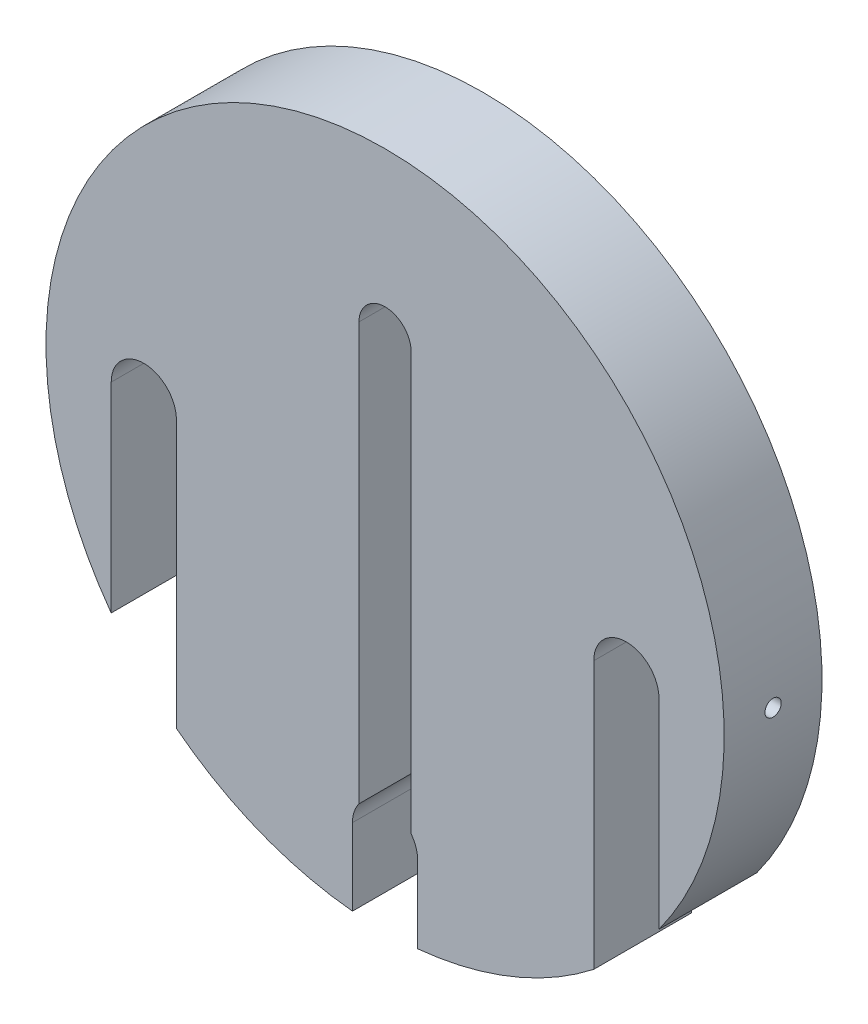
ISO-10303-21;
HEADER;
FILE_DESCRIPTION(('STEP AP214'),'2;1');
FILE_NAME('part.step','',(''),(''),'','','');
FILE_SCHEMA(('AUTOMOTIVE_DESIGN { 1 0 10303 214 1 1 1 1 }'));
ENDSEC;
DATA;
#1=APPLICATION_CONTEXT('core data for automotive mechanical design processes');
#2=APPLICATION_PROTOCOL_DEFINITION('international standard','automotive_design',2000,#1);
#3=PRODUCT_CONTEXT('',#1,'mechanical');
#4=PRODUCT('Part','Part','',(#3));
#5=PRODUCT_RELATED_PRODUCT_CATEGORY('part','',(#4));
#6=PRODUCT_DEFINITION_FORMATION('','',#4);
#7=PRODUCT_DEFINITION_CONTEXT('part definition',#1,'design');
#8=PRODUCT_DEFINITION('design','',#6,#7);
#9=PRODUCT_DEFINITION_SHAPE('','',#8);
#10=(LENGTH_UNIT() NAMED_UNIT(*) SI_UNIT(.MILLI.,.METRE.));
#11=(NAMED_UNIT(*) PLANE_ANGLE_UNIT() SI_UNIT($,.RADIAN.));
#12=(NAMED_UNIT(*) SI_UNIT($,.STERADIAN.) SOLID_ANGLE_UNIT());
#13=UNCERTAINTY_MEASURE_WITH_UNIT(LENGTH_MEASURE(1.E-05),#10,'distance_accuracy_value','');
#14=(GEOMETRIC_REPRESENTATION_CONTEXT(3) GLOBAL_UNCERTAINTY_ASSIGNED_CONTEXT((#13)) GLOBAL_UNIT_ASSIGNED_CONTEXT((#10,
#11,#12)) REPRESENTATION_CONTEXT('',''));
#15=CARTESIAN_POINT('',(0.,0.,0.));
#16=DIRECTION('',(0.,0.,1.));
#17=DIRECTION('',(1.,0.,0.));
#18=AXIS2_PLACEMENT_3D('',#15,#16,#17);
#19=CARTESIAN_POINT('',(0.,0.,15.));
#20=DIRECTION('',(0.,0.,1.));
#21=DIRECTION('',(1.,0.,0.));
#22=AXIS2_PLACEMENT_3D('',#19,#20,#21);
#23=PLANE('',#22);
#24=CARTESIAN_POINT('',(0.,27.,15.));
#25=DIRECTION('',(0.,0.,-1.));
#26=DIRECTION('',(-1.,0.,0.));
#27=AXIS2_PLACEMENT_3D('',#24,#25,#26);
#28=CIRCLE('',#27,4.00000000000005);
#29=CARTESIAN_POINT('',(-4.00000000000004,27.,15.));
#30=VERTEX_POINT('',#29);
#31=CARTESIAN_POINT('',(4.,27.000000608153,15.));
#32=VERTEX_POINT('',#31);
#33=EDGE_CURVE('E408',#30,#32,#28,.T.);
#34=ORIENTED_EDGE('',*,*,#33,.T.);
#35=DIRECTION('',(0.,-1.,0.));
#36=VECTOR('',#35,1.);
#37=CARTESIAN_POINT('',(4.,27.000000608153,15.));
#38=LINE('',#37,#36);
#39=CARTESIAN_POINT('',(4.00000000000001,-37.,15.));
#40=VERTEX_POINT('',#39);
#41=EDGE_CURVE('E407',#32,#40,#38,.T.);
#42=ORIENTED_EDGE('',*,*,#41,.T.);
#43=CARTESIAN_POINT('',(0.,-40.,15.));
#44=DIRECTION('',(0.,0.,1.));
#45=DIRECTION('',(1.,0.,0.));
#46=AXIS2_PLACEMENT_3D('',#43,#44,#45);
#47=CIRCLE('',#46,5.00000000000001);
#48=CARTESIAN_POINT('',(5.00000000000001,-40.,15.));
#49=VERTEX_POINT('',#48);
#50=EDGE_CURVE('E221',#49,#40,#47,.T.);
#51=ORIENTED_EDGE('',*,*,#50,.F.);
#52=DIRECTION('',(0.,1.,0.));
#53=VECTOR('',#52,1.);
#54=CARTESIAN_POINT('',(5.00000000000001,-40.,15.));
#55=LINE('',#54,#53);
#56=CARTESIAN_POINT('',(5.,-51.7590571784301,15.));
#57=VERTEX_POINT('',#56);
#58=EDGE_CURVE('E217',#57,#49,#55,.T.);
#59=ORIENTED_EDGE('',*,*,#58,.F.);
#60=CARTESIAN_POINT('',(0.,0.,15.));
#61=DIRECTION('',(0.,0.,1.));
#62=DIRECTION('',(1.,0.,0.));
#63=AXIS2_PLACEMENT_3D('',#60,#61,#62);
#64=CIRCLE('',#63,52.);
#65=CARTESIAN_POINT('',(32.,-40.9878030638384,15.));
#66=VERTEX_POINT('',#65);
#67=EDGE_CURVE('E251',#57,#66,#64,.T.);
#68=ORIENTED_EDGE('',*,*,#67,.T.);
#69=DIRECTION('',(0.,-1.,0.));
#70=VECTOR('',#69,1.);
#71=CARTESIAN_POINT('',(32.,0.,15.));
#72=LINE('',#71,#70);
#73=CARTESIAN_POINT('',(32.,0.,15.));
#74=VERTEX_POINT('',#73);
#75=EDGE_CURVE('E380',#74,#66,#72,.T.);
#76=ORIENTED_EDGE('',*,*,#75,.F.);
#77=CARTESIAN_POINT('',(37.,0.,15.));
#78=DIRECTION('',(0.,0.,1.));
#79=DIRECTION('',(-1.,0.,0.));
#80=AXIS2_PLACEMENT_3D('',#77,#78,#79);
#81=CIRCLE('',#80,5.00000000000001);
#82=CARTESIAN_POINT('',(42.,3.54103706807145E-07,15.));
#83=VERTEX_POINT('',#82);
#84=EDGE_CURVE('E385',#83,#74,#81,.T.);
#85=ORIENTED_EDGE('',*,*,#84,.F.);
#86=DIRECTION('',(0.,1.,0.));
#87=VECTOR('',#86,1.);
#88=CARTESIAN_POINT('',(42.,3.54103707564824E-07,15.));
#89=LINE('',#88,#87);
#90=CARTESIAN_POINT('',(42.,-30.6594194335118,15.));
#91=VERTEX_POINT('',#90);
#92=EDGE_CURVE('E205',#91,#83,#89,.T.);
#93=ORIENTED_EDGE('',*,*,#92,.F.);
#94=CARTESIAN_POINT('',(-42.,-30.6594194335118,15.));
#95=VERTEX_POINT('',#94);
#96=EDGE_CURVE('E248',#91,#95,#64,.T.);
#97=ORIENTED_EDGE('',*,*,#96,.T.);
#98=DIRECTION('',(0.,-1.,0.));
#99=VECTOR('',#98,1.);
#100=CARTESIAN_POINT('',(-42.,3.54103707564824E-07,15.));
#101=LINE('',#100,#99);
#102=CARTESIAN_POINT('',(-42.,3.54103707564824E-07,15.));
#103=VERTEX_POINT('',#102);
#104=EDGE_CURVE('E198',#103,#95,#101,.T.);
#105=ORIENTED_EDGE('',*,*,#104,.F.);
#106=CARTESIAN_POINT('',(-37.,0.,15.));
#107=DIRECTION('',(0.,0.,1.));
#108=DIRECTION('',(1.,0.,0.));
#109=AXIS2_PLACEMENT_3D('',#106,#107,#108);
#110=CIRCLE('',#109,5.00000000000001);
#111=CARTESIAN_POINT('',(-32.,0.,15.));
#112=VERTEX_POINT('',#111);
#113=EDGE_CURVE('E195',#112,#103,#110,.T.);
#114=ORIENTED_EDGE('',*,*,#113,.F.);
#115=DIRECTION('',(0.,1.,0.));
#116=VECTOR('',#115,1.);
#117=CARTESIAN_POINT('',(-32.,0.,15.));
#118=LINE('',#117,#116);
#119=CARTESIAN_POINT('',(-32.,-40.9878030638384,15.));
#120=VERTEX_POINT('',#119);
#121=EDGE_CURVE('E191',#120,#112,#118,.T.);
#122=ORIENTED_EDGE('',*,*,#121,.F.);
#123=CARTESIAN_POINT('',(-5.,-51.7590571784301,15.));
#124=VERTEX_POINT('',#123);
#125=EDGE_CURVE('E253',#120,#124,#64,.T.);
#126=ORIENTED_EDGE('',*,*,#125,.T.);
#127=DIRECTION('',(0.,-1.,0.));
#128=VECTOR('',#127,1.);
#129=CARTESIAN_POINT('',(-5.,-39.9999996458963,15.));
#130=LINE('',#129,#128);
#131=CARTESIAN_POINT('',(-5.,-39.9999996458963,15.));
#132=VERTEX_POINT('',#131);
#133=EDGE_CURVE('E224',#132,#124,#130,.T.);
#134=ORIENTED_EDGE('',*,*,#133,.F.);
#135=CARTESIAN_POINT('',(-4.,-37.,15.));
#136=VERTEX_POINT('',#135);
#137=EDGE_CURVE('E219',#136,#132,#47,.T.);
#138=ORIENTED_EDGE('',*,*,#137,.F.);
#139=DIRECTION('',(0.,-1.,0.));
#140=VECTOR('',#139,1.);
#141=CARTESIAN_POINT('',(-4.00000000000004,27.,15.));
#142=LINE('',#141,#140);
#143=EDGE_CURVE('E368',#30,#136,#142,.T.);
#144=ORIENTED_EDGE('',*,*,#143,.F.);
#145=EDGE_LOOP('',(#34,#42,#51,#59,#68,#76,#85,#93,#97,#105,#114,#122,#126,#134,#138,#144));
#146=FACE_BOUND('',#145,.T.);
#147=ADVANCED_FACE('F37',(#146),#23,.T.);
#148=CARTESIAN_POINT('',(0.,0.,0.));
#149=DIRECTION('',(0.,0.,1.));
#150=DIRECTION('',(1.,0.,0.));
#151=AXIS2_PLACEMENT_3D('',#148,#149,#150);
#152=PLANE('',#151);
#153=DIRECTION('',(0.,-1.,0.));
#154=VECTOR('',#153,1.);
#155=CARTESIAN_POINT('',(4.,0.,0.));
#156=LINE('',#155,#154);
#157=CARTESIAN_POINT('',(4.,27.000000608153,0.));
#158=VERTEX_POINT('',#157);
#159=CARTESIAN_POINT('',(4.00000000000001,-37.,0.));
#160=VERTEX_POINT('',#159);
#161=EDGE_CURVE('E220',#158,#160,#156,.T.);
#162=ORIENTED_EDGE('',*,*,#161,.F.);
#163=CARTESIAN_POINT('',(0.,27.,0.));
#164=DIRECTION('',(0.,0.,1.));
#165=DIRECTION('',(1.,0.,0.));
#166=AXIS2_PLACEMENT_3D('',#163,#164,#165);
#167=CIRCLE('',#166,4.00000000000005);
#168=CARTESIAN_POINT('',(-4.00000000000004,27.,0.));
#169=VERTEX_POINT('',#168);
#170=EDGE_CURVE('E270',#169,#158,#167,.F.);
#171=ORIENTED_EDGE('',*,*,#170,.F.);
#172=DIRECTION('',(0.,-1.,0.));
#173=VECTOR('',#172,1.);
#174=CARTESIAN_POINT('',(-4.00000000000002,0.,0.));
#175=LINE('',#174,#173);
#176=CARTESIAN_POINT('',(-4.,-37.,0.));
#177=VERTEX_POINT('',#176);
#178=EDGE_CURVE('E399',#169,#177,#175,.T.);
#179=ORIENTED_EDGE('',*,*,#178,.T.);
#180=CARTESIAN_POINT('',(0.,-40.,0.));
#181=DIRECTION('',(0.,0.,1.));
#182=DIRECTION('',(1.,0.,0.));
#183=AXIS2_PLACEMENT_3D('',#180,#181,#182);
#184=CIRCLE('',#183,5.00000000000001);
#185=CARTESIAN_POINT('',(-5.,-39.9999996458963,0.));
#186=VERTEX_POINT('',#185);
#187=EDGE_CURVE('E213',#177,#186,#184,.T.);
#188=ORIENTED_EDGE('',*,*,#187,.T.);
#189=DIRECTION('',(0.,-1.,0.));
#190=VECTOR('',#189,1.);
#191=CARTESIAN_POINT('',(-5.,-39.9999996458963,0.));
#192=LINE('',#191,#190);
#193=CARTESIAN_POINT('',(-5.,-51.7590571784301,0.));
#194=VERTEX_POINT('',#193);
#195=EDGE_CURVE('E212',#186,#194,#192,.T.);
#196=ORIENTED_EDGE('',*,*,#195,.T.);
#197=CARTESIAN_POINT('',(0.,0.,0.));
#198=DIRECTION('',(0.,0.,1.));
#199=DIRECTION('',(1.,0.,0.));
#200=AXIS2_PLACEMENT_3D('',#197,#198,#199);
#201=CIRCLE('',#200,52.);
#202=CARTESIAN_POINT('',(-32.,-40.9878030638384,0.));
#203=VERTEX_POINT('',#202);
#204=EDGE_CURVE('E252',#203,#194,#201,.T.);
#205=ORIENTED_EDGE('',*,*,#204,.F.);
#206=DIRECTION('',(0.,1.,0.));
#207=VECTOR('',#206,1.);
#208=CARTESIAN_POINT('',(-32.,0.,0.));
#209=LINE('',#208,#207);
#210=CARTESIAN_POINT('',(-32.,0.,0.));
#211=VERTEX_POINT('',#210);
#212=EDGE_CURVE('E260',#203,#211,#209,.T.);
#213=ORIENTED_EDGE('',*,*,#212,.T.);
#214=CARTESIAN_POINT('',(-37.,0.,0.));
#215=DIRECTION('',(0.,0.,1.));
#216=DIRECTION('',(1.,0.,0.));
#217=AXIS2_PLACEMENT_3D('',#214,#215,#216);
#218=CIRCLE('',#217,5.00000000000001);
#219=CARTESIAN_POINT('',(-42.,3.54103707564824E-07,0.));
#220=VERTEX_POINT('',#219);
#221=EDGE_CURVE('E187',#211,#220,#218,.T.);
#222=ORIENTED_EDGE('',*,*,#221,.T.);
#223=DIRECTION('',(0.,-1.,0.));
#224=VECTOR('',#223,1.);
#225=CARTESIAN_POINT('',(-42.,3.54103707564824E-07,0.));
#226=LINE('',#225,#224);
#227=CARTESIAN_POINT('',(-42.,-30.6594194335118,0.));
#228=VERTEX_POINT('',#227);
#229=EDGE_CURVE('E190',#220,#228,#226,.T.);
#230=ORIENTED_EDGE('',*,*,#229,.T.);
#231=CARTESIAN_POINT('',(42.,-30.6594194335118,0.));
#232=VERTEX_POINT('',#231);
#233=EDGE_CURVE('E247',#232,#228,#201,.T.);
#234=ORIENTED_EDGE('',*,*,#233,.F.);
#235=DIRECTION('',(0.,1.,0.));
#236=VECTOR('',#235,1.);
#237=CARTESIAN_POINT('',(42.,0.,0.));
#238=LINE('',#237,#236);
#239=CARTESIAN_POINT('',(42.,3.54103706807145E-07,0.));
#240=VERTEX_POINT('',#239);
#241=EDGE_CURVE('E263',#232,#240,#238,.T.);
#242=ORIENTED_EDGE('',*,*,#241,.T.);
#243=CARTESIAN_POINT('',(37.,0.,0.));
#244=DIRECTION('',(0.,0.,1.));
#245=DIRECTION('',(-1.,0.,0.));
#246=AXIS2_PLACEMENT_3D('',#243,#244,#245);
#247=CIRCLE('',#246,5.00000000000001);
#248=CARTESIAN_POINT('',(32.,0.,0.));
#249=VERTEX_POINT('',#248);
#250=EDGE_CURVE('E178',#240,#249,#247,.T.);
#251=ORIENTED_EDGE('',*,*,#250,.T.);
#252=DIRECTION('',(0.,-1.,0.));
#253=VECTOR('',#252,1.);
#254=CARTESIAN_POINT('',(32.,0.,0.));
#255=LINE('',#254,#253);
#256=CARTESIAN_POINT('',(32.,-40.9878030638384,0.));
#257=VERTEX_POINT('',#256);
#258=EDGE_CURVE('E184',#249,#257,#255,.T.);
#259=ORIENTED_EDGE('',*,*,#258,.T.);
#260=CARTESIAN_POINT('',(5.,-51.7590571784301,0.));
#261=VERTEX_POINT('',#260);
#262=EDGE_CURVE('E256',#261,#257,#201,.T.);
#263=ORIENTED_EDGE('',*,*,#262,.F.);
#264=DIRECTION('',(0.,1.,0.));
#265=VECTOR('',#264,1.);
#266=CARTESIAN_POINT('',(5.00000000000005,0.,0.));
#267=LINE('',#266,#265);
#268=CARTESIAN_POINT('',(5.00000000000001,-40.,0.));
#269=VERTEX_POINT('',#268);
#270=EDGE_CURVE('E257',#261,#269,#267,.T.);
#271=ORIENTED_EDGE('',*,*,#270,.T.);
#272=EDGE_CURVE('E209',#269,#160,#184,.T.);
#273=ORIENTED_EDGE('',*,*,#272,.T.);
#274=EDGE_LOOP('',(#162,#171,#179,#188,#196,#205,#213,#222,#230,#234,#242,#251,#259,#263,#271,#273));
#275=FACE_BOUND('',#274,.T.);
#276=ADVANCED_FACE('F289',(#275),#152,.F.);
#277=CARTESIAN_POINT('',(0.,-40.,0.));
#278=DIRECTION('',(0.,0.,1.));
#279=DIRECTION('',(1.,0.,0.));
#280=AXIS2_PLACEMENT_3D('',#277,#278,#279);
#281=CYLINDRICAL_SURFACE('',#280,5.00000000000001);
#282=DIRECTION('',(0.,0.,1.));
#283=VECTOR('',#282,1.);
#284=CARTESIAN_POINT('',(4.00000000000001,-37.,0.));
#285=LINE('',#284,#283);
#286=EDGE_CURVE('E268',#160,#40,#285,.T.);
#287=ORIENTED_EDGE('',*,*,#286,.F.);
#288=ORIENTED_EDGE('',*,*,#272,.F.);
#289=DIRECTION('',(0.,0.,1.));
#290=VECTOR('',#289,1.);
#291=CARTESIAN_POINT('',(5.00000000000001,-40.,0.));
#292=LINE('',#291,#290);
#293=EDGE_CURVE('E216',#269,#49,#292,.T.);
#294=ORIENTED_EDGE('',*,*,#293,.T.);
#295=ORIENTED_EDGE('',*,*,#50,.T.);
#296=EDGE_LOOP('',(#287,#288,#294,#295));
#297=FACE_BOUND('',#296,.T.);
#298=ADVANCED_FACE('F346',(#297),#281,.F.);
#299=CARTESIAN_POINT('',(0.,0.,15.));
#300=DIRECTION('',(0.,0.,-1.));
#301=DIRECTION('',(-1.,0.,0.));
#302=AXIS2_PLACEMENT_3D('',#299,#300,#301);
#303=CYLINDRICAL_SURFACE('',#302,52.);
#304=CARTESIAN_POINT('',(52.,0.,6.25));
#305=CARTESIAN_POINT('',(51.9999997973088,-0.0702021682383052,6.25000311220363));
#306=CARTESIAN_POINT('',(51.9998563106322,-0.140454981299909,6.25593386660927));
#307=CARTESIAN_POINT('',(51.9992977076948,-0.279025061692463,6.27951009979809));
#308=CARTESIAN_POINT('',(51.9988822660898,-0.347339908342714,6.29716961025872));
#309=CARTESIAN_POINT('',(51.9978268063139,-0.480006518674068,6.34369966980517));
#310=CARTESIAN_POINT('',(51.9971868970909,-0.544360187175891,6.37256478085578));
#311=CARTESIAN_POINT('',(51.9957547048813,-0.667290326060267,6.44067898451166));
#312=CARTESIAN_POINT('',(51.994962459352,-0.725868211277511,6.47992552536564));
#313=CARTESIAN_POINT('',(51.9933145119984,-0.835622273193974,6.56770483640095));
#314=CARTESIAN_POINT('',(51.992458792151,-0.886796335352946,6.6162402503378));
#315=CARTESIAN_POINT('',(51.990780501975,-0.980272465512588,6.72121538076444));
#316=CARTESIAN_POINT('',(51.9899579329611,-1.02257418194791,6.77765541032568));
#317=CARTESIAN_POINT('',(51.9884386382574,-1.09710656749047,6.8968434905856));
#318=CARTESIAN_POINT('',(51.9877419254735,-1.12933620399878,6.9595921871836));
#319=CARTESIAN_POINT('',(51.9865530399832,-1.18280272821267,7.08961174165532));
#320=CARTESIAN_POINT('',(51.9860608666028,-1.20403965213251,7.15688258463052));
#321=CARTESIAN_POINT('',(51.9853366665823,-1.23491401602256,7.29402307537363));
#322=CARTESIAN_POINT('',(51.9851045894986,-1.24455370521054,7.36389221650566));
#323=CARTESIAN_POINT('',(51.9849265971695,-1.25196688375206,7.50425738102641));
#324=CARTESIAN_POINT('',(51.9849806810062,-1.24974041116973,7.5747534024035));
#325=CARTESIAN_POINT('',(51.985368864565,-1.23348639528717,7.71435593657015));
#326=CARTESIAN_POINT('',(51.9857029064413,-1.21946128985313,7.78346273338511));
#327=CARTESIAN_POINT('',(51.9866132572273,-1.18001189587483,7.91834067716101));
#328=CARTESIAN_POINT('',(51.9871895665711,-1.15458758690517,7.98411181814478));
#329=CARTESIAN_POINT('',(51.9885195494868,-1.09305869575102,8.11045924385023));
#330=CARTESIAN_POINT('',(51.9892732416252,-1.05695299544567,8.17103498386411));
#331=CARTESIAN_POINT('',(51.9908730034263,-0.975087078618902,8.28526608230648));
#332=CARTESIAN_POINT('',(51.9917190732111,-0.929326849329945,8.33892143158303));
#333=CARTESIAN_POINT('',(51.9934084671118,-0.829437040423046,8.43780288140086));
#334=CARTESIAN_POINT('',(51.9942517904784,-0.775305344685604,8.48302684428369));
#335=CARTESIAN_POINT('',(51.9958404130572,-0.660216686710964,8.56374531101953));
#336=CARTESIAN_POINT('',(51.9965857122549,-0.599259723452948,8.59923981341735));
#337=CARTESIAN_POINT('',(51.9978942734955,-0.472249722743773,8.65949153987308));
#338=CARTESIAN_POINT('',(51.998457534427,-0.40619665417872,8.6842486983688));
#339=CARTESIAN_POINT('',(51.9993385034976,-0.27087000044249,8.7223216062816));
#340=CARTESIAN_POINT('',(51.9996562120698,-0.201596420951345,8.73563737587711));
#341=CARTESIAN_POINT('',(52.0000102060239,-0.0618137651800235,8.75044690061213));
#342=CARTESIAN_POINT('',(52.0000465618082,0.00869499759668231,8.75194361321069));
#343=CARTESIAN_POINT('',(51.9998339381804,0.148962822072931,8.74308024207334));
#344=CARTESIAN_POINT('',(51.999584958976,0.218721884317889,8.73272016696394));
#345=CARTESIAN_POINT('',(51.9988297746627,0.355501843431972,8.70043975528012));
#346=CARTESIAN_POINT('',(51.9983235993952,0.422523056986941,8.67852075982413));
#347=CARTESIAN_POINT('',(51.9971110716701,0.551934524088054,8.62374607673541));
#348=CARTESIAN_POINT('',(51.9964047189633,0.614324771868786,8.5908903754871));
#349=CARTESIAN_POINT('',(51.9948712555013,0.732716877463098,8.51516732123365));
#350=CARTESIAN_POINT('',(51.9940441207374,0.788717461205737,8.47229797672667));
#351=CARTESIAN_POINT('',(51.9923624037812,0.892727786468902,8.37776747133739));
#352=CARTESIAN_POINT('',(51.9915078215399,0.940737513734256,8.32610629477137));
#353=CARTESIAN_POINT('',(51.9898673520108,1.02741314608396,8.21544594624026));
#354=CARTESIAN_POINT('',(51.9890814787735,1.06607714286236,8.15644527934256));
#355=CARTESIAN_POINT('',(51.9876672513446,1.13295071499423,8.03278844476162));
#356=CARTESIAN_POINT('',(51.9870388968654,1.16116030943127,7.96813228740223));
#357=CARTESIAN_POINT('',(51.986010651412,1.20632097468798,7.83500703297695));
#358=CARTESIAN_POINT('',(51.9856107352912,1.22327328474351,7.76653835650436));
#359=CARTESIAN_POINT('',(51.9850843844908,1.2454422349171,7.62772563951998));
#360=CARTESIAN_POINT('',(51.9849579498333,1.25065887408153,7.5573815988558));
#361=CARTESIAN_POINT('',(51.9849928263669,1.24920824130315,7.41683417053418));
#362=CARTESIAN_POINT('',(51.9851540645164,1.2425439859774,7.34663075170298));
#363=CARTESIAN_POINT('',(51.9857459562054,1.21752692509744,7.20833944412384));
#364=CARTESIAN_POINT('',(51.9861766102819,1.19917409623921,7.14025155959403));
#365=CARTESIAN_POINT('',(51.9872587771959,1.15130111652815,7.00812254258516));
#366=CARTESIAN_POINT('',(51.9879102939352,1.12178076839044,6.94408148162043));
#367=CARTESIAN_POINT('',(51.9893607072791,1.05241221955216,6.82186616244462));
#368=CARTESIAN_POINT('',(51.9901595983903,1.01256440379106,6.76369168567845));
#369=CARTESIAN_POINT('',(51.9918148782012,0.923664908008776,6.65484810987456));
#370=CARTESIAN_POINT('',(51.9926712753634,0.874611871432861,6.60418011902436));
#371=CARTESIAN_POINT('',(51.9943451604329,0.768681400797779,6.51178498268632));
#372=CARTESIAN_POINT('',(51.9951626386401,0.711802029727766,6.47006005715846));
#373=CARTESIAN_POINT('',(51.9966667561244,0.591815678316268,6.39673083564491));
#374=CARTESIAN_POINT('',(51.9973533183375,0.528705062911211,6.36513249328728));
#375=CARTESIAN_POINT('',(51.9985167523366,0.398121936425729,6.31301654483188));
#376=CARTESIAN_POINT('',(51.9989938745217,0.330654745279389,6.29248570008038));
#377=CARTESIAN_POINT('',(51.9995568847199,0.218966673914316,6.26853953100294));
#378=CARTESIAN_POINT('',(51.9997223338085,0.175471023124023,6.26159592793198));
#379=CARTESIAN_POINT('',(51.9999439549651,0.0879902146157654,6.25232518744696));
#380=CARTESIAN_POINT('',(52.0000001270536,0.0440050569896061,6.24999804916712));
#381=CARTESIAN_POINT('',(52.,0.,6.25));
#382=B_SPLINE_CURVE_WITH_KNOTS('',3,(#304,#305,#306,#307,#308,#309,#310,#311,#312,#313,#314,
#315,#316,#317,#318,#319,#320,#321,#322,#323,#324,#325,#326,#327,#328,#329,#330,#331,#332,#333,
#334,#335,#336,#337,#338,#339,#340,#341,#342,#343,#344,#345,#346,#347,#348,#349,#350,#351,#352,
#353,#354,#355,#356,#357,#358,#359,#360,#361,#362,#363,#364,#365,#366,#367,#368,#369,#370,#371,
#372,#373,#374,#375,#376,#377,#378,#379,#380,#381),.UNSPECIFIED.,.T.,.F.,(4,2,2,2,2,2,2,2,2,2,2,
2,2,2,2,2,2,2,2,2,2,2,2,2,2,2,2,2,2,2,2,2,2,2,2,2,2,2,4),(0.,0.210445882636134,
0.421143986447301,0.631739966839943,0.842284230848761,1.05288850833586,1.26350112940933,
1.47413533560462,1.68476884788466,1.89536150240307,2.10595348138537,2.31650195795435,
2.52705081179124,2.73762171354373,2.94819289376539,3.15881738893704,3.36944191561073,
3.58006772833867,3.79069316959878,4.00126590480426,4.21183848680563,4.42238664259345,
4.63293506050298,4.84352538774548,5.0541160906635,5.26474975786886,5.47538304057948,
5.68599313229698,5.89660324112857,6.10715988264211,6.31771694395336,6.52827772513008,
6.73883065912657,6.94941464628389,7.16005084685616,7.37081065859629,7.58131780232444,
7.71323231476464,7.84514680246529),.UNSPECIFIED.);
#383=CARTESIAN_POINT('',(52.,0.,6.25));
#384=VERTEX_POINT('',#383);
#385=EDGE_CURVE('E173',#384,#384,#382,.T.);
#386=ORIENTED_EDGE('',*,*,#385,.T.);
#387=EDGE_LOOP('',(#386));
#388=FACE_BOUND('',#387,.T.);
#389=CARTESIAN_POINT('',(-52.,0.,8.74999999999999));
#390=CARTESIAN_POINT('',(-51.9999997973088,-0.0702021682383054,8.74999688779635));
#391=CARTESIAN_POINT('',(-51.9998563106322,-0.14045498129991,8.74406613339072));
#392=CARTESIAN_POINT('',(-51.9992977076948,-0.279025061692464,8.7204899002019));
#393=CARTESIAN_POINT('',(-51.9988822660898,-0.347339908342714,8.70283038974126));
#394=CARTESIAN_POINT('',(-51.9978268063139,-0.480006518674068,8.65630033019482));
#395=CARTESIAN_POINT('',(-51.9971868970909,-0.544360187175891,8.62743521914421));
#396=CARTESIAN_POINT('',(-51.9957547048813,-0.667290326060267,8.55932101548832));
#397=CARTESIAN_POINT('',(-51.994962459352,-0.725868211277511,8.52007447463434));
#398=CARTESIAN_POINT('',(-51.9933145119984,-0.835622273193974,8.43229516359904));
#399=CARTESIAN_POINT('',(-51.992458792151,-0.886796335352947,8.38375974966219));
#400=CARTESIAN_POINT('',(-51.990780501975,-0.980272465512589,8.27878461923555));
#401=CARTESIAN_POINT('',(-51.9899579329611,-1.02257418194791,8.22234458967431));
#402=CARTESIAN_POINT('',(-51.9884386382574,-1.09710656749047,8.10315650941439));
#403=CARTESIAN_POINT('',(-51.9877419254735,-1.12933620399878,8.04040781281639));
#404=CARTESIAN_POINT('',(-51.9865530399832,-1.18280272821267,7.91038825834466));
#405=CARTESIAN_POINT('',(-51.9860608666028,-1.20403965213251,7.84311741536946));
#406=CARTESIAN_POINT('',(-51.9853366665823,-1.23491401602256,7.70597692462635));
#407=CARTESIAN_POINT('',(-51.9851045894986,-1.24455370521054,7.63610778349432));
#408=CARTESIAN_POINT('',(-51.9849265971695,-1.25196688375206,7.49574261897358));
#409=CARTESIAN_POINT('',(-51.9849806810062,-1.24974041116973,7.42524659759648));
#410=CARTESIAN_POINT('',(-51.985368864565,-1.23348639528717,7.28564406342984));
#411=CARTESIAN_POINT('',(-51.9857029064413,-1.21946128985313,7.21653726661487));
#412=CARTESIAN_POINT('',(-51.9866132572273,-1.18001189587483,7.08165932283898));
#413=CARTESIAN_POINT('',(-51.9871895665711,-1.15458758690517,7.0158881818552));
#414=CARTESIAN_POINT('',(-51.9885195494868,-1.09305869575102,6.88954075614975));
#415=CARTESIAN_POINT('',(-51.9892732416252,-1.05695299544567,6.82896501613588));
#416=CARTESIAN_POINT('',(-51.9908730034263,-0.975087078618901,6.71473391769351));
#417=CARTESIAN_POINT('',(-51.9917190732111,-0.929326849329944,6.66107856841696));
#418=CARTESIAN_POINT('',(-51.9934084671118,-0.829437040423045,6.56219711859913));
#419=CARTESIAN_POINT('',(-51.9942517904784,-0.775305344685603,6.5169731557163));
#420=CARTESIAN_POINT('',(-51.9958404130572,-0.660216686710963,6.43625468898046));
#421=CARTESIAN_POINT('',(-51.9965857122549,-0.599259723452947,6.40076018658263));
#422=CARTESIAN_POINT('',(-51.9978942734955,-0.472249722743772,6.34050846012691));
#423=CARTESIAN_POINT('',(-51.998457534427,-0.40619665417872,6.31575130163119));
#424=CARTESIAN_POINT('',(-51.9993385034976,-0.27087000044249,6.27767839371839));
#425=CARTESIAN_POINT('',(-51.9996562120698,-0.201596420951345,6.26436262412288));
#426=CARTESIAN_POINT('',(-52.0000102060239,-0.0618137651800236,6.24955309938786));
#427=CARTESIAN_POINT('',(-52.0000465618082,0.00869499759668254,6.24805638678929));
#428=CARTESIAN_POINT('',(-51.9998339381804,0.148962822072932,6.25691975792665));
#429=CARTESIAN_POINT('',(-51.999584958976,0.21872188431789,6.26727983303604));
#430=CARTESIAN_POINT('',(-51.9988297746627,0.355501843431973,6.29956024471986));
#431=CARTESIAN_POINT('',(-51.9983235993952,0.422523056986942,6.32147924017586));
#432=CARTESIAN_POINT('',(-51.9971110716701,0.551934524088055,6.37625392326458));
#433=CARTESIAN_POINT('',(-51.9964047189633,0.614324771868787,6.40910962451289));
#434=CARTESIAN_POINT('',(-51.9948712555013,0.732716877463099,6.48483267876633));
#435=CARTESIAN_POINT('',(-51.9940441207374,0.788717461205738,6.52770202327332));
#436=CARTESIAN_POINT('',(-51.9923624037812,0.892727786468903,6.6222325286626));
#437=CARTESIAN_POINT('',(-51.9915078215399,0.940737513734257,6.67389370522862));
#438=CARTESIAN_POINT('',(-51.9898673520108,1.02741314608396,6.78455405375973));
#439=CARTESIAN_POINT('',(-51.9890814787735,1.06607714286236,6.84355472065743));
#440=CARTESIAN_POINT('',(-51.9876672513446,1.13295071499423,6.96721155523837));
#441=CARTESIAN_POINT('',(-51.9870388968654,1.16116030943127,7.03186771259776));
#442=CARTESIAN_POINT('',(-51.986010651412,1.20632097468798,7.16499296702304));
#443=CARTESIAN_POINT('',(-51.9856107352912,1.22327328474351,7.23346164349563));
#444=CARTESIAN_POINT('',(-51.9850843844908,1.2454422349171,7.37227436048001));
#445=CARTESIAN_POINT('',(-51.9849579498333,1.25065887408153,7.44261840114419));
#446=CARTESIAN_POINT('',(-51.9849928263669,1.24920824130315,7.5831658294658));
#447=CARTESIAN_POINT('',(-51.9851540645164,1.2425439859774,7.65336924829701));
#448=CARTESIAN_POINT('',(-51.9857459562054,1.21752692509744,7.79166055587615));
#449=CARTESIAN_POINT('',(-51.9861766102819,1.19917409623921,7.85974844040596));
#450=CARTESIAN_POINT('',(-51.9872587771959,1.15130111652815,7.99187745741483));
#451=CARTESIAN_POINT('',(-51.9879102939352,1.12178076839044,8.05591851837956));
#452=CARTESIAN_POINT('',(-51.9893607072791,1.05241221955216,8.17813383755537));
#453=CARTESIAN_POINT('',(-51.9901595983903,1.01256440379105,8.23630831432154));
#454=CARTESIAN_POINT('',(-51.9918148782012,0.923664908008775,8.34515189012543));
#455=CARTESIAN_POINT('',(-51.9926712753634,0.874611871432859,8.39581988097564));
#456=CARTESIAN_POINT('',(-51.9943451604329,0.768681400797777,8.48821501731367));
#457=CARTESIAN_POINT('',(-51.9951626386401,0.711802029727764,8.52993994284153));
#458=CARTESIAN_POINT('',(-51.9966667561244,0.591815678316265,8.60326916435508));
#459=CARTESIAN_POINT('',(-51.9973533183375,0.528705062911209,8.63486750671271));
#460=CARTESIAN_POINT('',(-51.9985167523366,0.398121936425727,8.68698345516811));
#461=CARTESIAN_POINT('',(-51.9989938745217,0.330654745279387,8.70751429991961));
#462=CARTESIAN_POINT('',(-51.9995568847199,0.218966673914315,8.73146046899705));
#463=CARTESIAN_POINT('',(-51.9997223338085,0.175471023124022,8.738404072068));
#464=CARTESIAN_POINT('',(-51.9999439549651,0.0879902146157652,8.74767481255302));
#465=CARTESIAN_POINT('',(-52.0000001270536,0.0440050569896061,8.75000195083287));
#466=CARTESIAN_POINT('',(-52.,0.,8.74999999999999));
#467=B_SPLINE_CURVE_WITH_KNOTS('',3,(#389,#390,#391,#392,#393,#394,#395,#396,#397,#398,#399,
#400,#401,#402,#403,#404,#405,#406,#407,#408,#409,#410,#411,#412,#413,#414,#415,#416,#417,#418,
#419,#420,#421,#422,#423,#424,#425,#426,#427,#428,#429,#430,#431,#432,#433,#434,#435,#436,#437,
#438,#439,#440,#441,#442,#443,#444,#445,#446,#447,#448,#449,#450,#451,#452,#453,#454,#455,#456,
#457,#458,#459,#460,#461,#462,#463,#464,#465,#466),.UNSPECIFIED.,.T.,.F.,(4,2,2,2,2,2,2,2,2,2,2,
2,2,2,2,2,2,2,2,2,2,2,2,2,2,2,2,2,2,2,2,2,2,2,2,2,2,2,4),(0.,0.210445882636135,
0.421143986447301,0.631739966839943,0.842284230848761,1.05288850833586,1.26350112940933,
1.47413533560462,1.68476884788466,1.89536150240307,2.10595348138537,2.31650195795435,
2.52705081179124,2.73762171354373,2.94819289376539,3.15881738893704,3.36944191561073,
3.58006772833867,3.79069316959878,4.00126590480426,4.21183848680563,4.42238664259345,
4.63293506050298,4.84352538774548,5.0541160906635,5.26474975786886,5.47538304057948,
5.68599313229698,5.89660324112857,6.10715988264211,6.31771694395336,6.52827772513008,
6.73883065912657,6.94941464628389,7.16005084685616,7.37081065859629,7.58131780232444,
7.71323231476464,7.84514680246529),.UNSPECIFIED.);
#468=CARTESIAN_POINT('',(-52.,0.,8.74999999999999));
#469=VERTEX_POINT('',#468);
#470=EDGE_CURVE('E293',#469,#469,#467,.T.);
#471=ORIENTED_EDGE('',*,*,#470,.T.);
#472=EDGE_LOOP('',(#471));
#473=FACE_BOUND('',#472,.T.);
#474=ORIENTED_EDGE('',*,*,#96,.F.);
#475=DIRECTION('',(0.,0.,-1.));
#476=VECTOR('',#475,1.);
#477=CARTESIAN_POINT('',(42.,-30.6594194335118,15.));
#478=LINE('',#477,#476);
#479=EDGE_CURVE('E244',#91,#232,#478,.T.);
#480=ORIENTED_EDGE('',*,*,#479,.T.);
#481=ORIENTED_EDGE('',*,*,#233,.T.);
#482=DIRECTION('',(0.,0.,-1.));
#483=VECTOR('',#482,1.);
#484=CARTESIAN_POINT('',(-42.,-30.6594194335118,15.));
#485=LINE('',#484,#483);
#486=EDGE_CURVE('E235',#228,#95,#485,.F.);
#487=ORIENTED_EDGE('',*,*,#486,.T.);
#488=EDGE_LOOP('',(#474,#480,#481,#487));
#489=FACE_BOUND('',#488,.T.);
#490=ADVANCED_FACE('F288',(#388,#473,#489),#303,.T.);
#491=ORIENTED_EDGE('',*,*,#125,.F.);
#492=DIRECTION('',(0.,0.,-1.));
#493=VECTOR('',#492,1.);
#494=CARTESIAN_POINT('',(-32.,-40.9878030638384,15.));
#495=LINE('',#494,#493);
#496=EDGE_CURVE('E238',#120,#203,#495,.T.);
#497=ORIENTED_EDGE('',*,*,#496,.T.);
#498=ORIENTED_EDGE('',*,*,#204,.T.);
#499=DIRECTION('',(0.,0.,-1.));
#500=VECTOR('',#499,1.);
#501=CARTESIAN_POINT('',(-5.,-51.7590571784301,15.));
#502=LINE('',#501,#500);
#503=EDGE_CURVE('E182',#194,#124,#502,.F.);
#504=ORIENTED_EDGE('',*,*,#503,.T.);
#505=EDGE_LOOP('',(#491,#497,#498,#504));
#506=FACE_BOUND('',#505,.T.);
#507=ADVANCED_FACE('F286',(#506),#303,.T.);
#508=ORIENTED_EDGE('',*,*,#262,.T.);
#509=DIRECTION('',(0.,0.,-1.));
#510=VECTOR('',#509,1.);
#511=CARTESIAN_POINT('',(32.,-40.9878030638384,15.));
#512=LINE('',#511,#510);
#513=EDGE_CURVE('E241',#257,#66,#512,.F.);
#514=ORIENTED_EDGE('',*,*,#513,.T.);
#515=ORIENTED_EDGE('',*,*,#67,.F.);
#516=DIRECTION('',(0.,0.,-1.));
#517=VECTOR('',#516,1.);
#518=CARTESIAN_POINT('',(5.,-51.7590571784301,15.));
#519=LINE('',#518,#517);
#520=EDGE_CURVE('E232',#57,#261,#519,.T.);
#521=ORIENTED_EDGE('',*,*,#520,.T.);
#522=EDGE_LOOP('',(#508,#514,#515,#521));
#523=FACE_BOUND('',#522,.T.);
#524=ADVANCED_FACE('F281',(#523),#303,.T.);
#525=CARTESIAN_POINT('',(5.00000000000001,-40.,0.));
#526=DIRECTION('',(1.,0.,0.));
#527=DIRECTION('',(0.,1.,0.));
#528=AXIS2_PLACEMENT_3D('',#525,#526,#527);
#529=PLANE('',#528);
#530=ORIENTED_EDGE('',*,*,#58,.T.);
#531=ORIENTED_EDGE('',*,*,#293,.F.);
#532=ORIENTED_EDGE('',*,*,#270,.F.);
#533=ORIENTED_EDGE('',*,*,#520,.F.);
#534=EDGE_LOOP('',(#530,#531,#532,#533));
#535=FACE_BOUND('',#534,.T.);
#536=ADVANCED_FACE('F285',(#535),#529,.F.);
#537=CARTESIAN_POINT('',(-5.,-39.9999996458963,0.));
#538=DIRECTION('',(-1.,0.,0.));
#539=DIRECTION('',(0.,0.,1.));
#540=AXIS2_PLACEMENT_3D('',#537,#538,#539);
#541=PLANE('',#540);
#542=ORIENTED_EDGE('',*,*,#195,.F.);
#543=DIRECTION('',(0.,0.,1.));
#544=VECTOR('',#543,1.);
#545=CARTESIAN_POINT('',(-5.,-39.9999996458963,0.));
#546=LINE('',#545,#544);
#547=EDGE_CURVE('E199',#186,#132,#546,.T.);
#548=ORIENTED_EDGE('',*,*,#547,.T.);
#549=ORIENTED_EDGE('',*,*,#133,.T.);
#550=ORIENTED_EDGE('',*,*,#503,.F.);
#551=EDGE_LOOP('',(#542,#548,#549,#550));
#552=FACE_BOUND('',#551,.T.);
#553=ADVANCED_FACE('F352',(#552),#541,.F.);
#554=ORIENTED_EDGE('',*,*,#187,.F.);
#555=DIRECTION('',(0.,0.,1.));
#556=VECTOR('',#555,1.);
#557=CARTESIAN_POINT('',(-4.,-37.,0.));
#558=LINE('',#557,#556);
#559=EDGE_CURVE('E265',#177,#136,#558,.T.);
#560=ORIENTED_EDGE('',*,*,#559,.T.);
#561=ORIENTED_EDGE('',*,*,#137,.T.);
#562=ORIENTED_EDGE('',*,*,#547,.F.);
#563=EDGE_LOOP('',(#554,#560,#561,#562));
#564=FACE_BOUND('',#563,.T.);
#565=ADVANCED_FACE('F333',(#564),#281,.F.);
#566=CARTESIAN_POINT('',(-32.,0.,0.));
#567=DIRECTION('',(1.,0.,0.));
#568=DIRECTION('',(0.,1.,0.));
#569=AXIS2_PLACEMENT_3D('',#566,#567,#568);
#570=PLANE('',#569);
#571=ORIENTED_EDGE('',*,*,#121,.T.);
#572=DIRECTION('',(0.,0.,1.));
#573=VECTOR('',#572,1.);
#574=CARTESIAN_POINT('',(-32.,0.,0.));
#575=LINE('',#574,#573);
#576=EDGE_CURVE('E202',#211,#112,#575,.T.);
#577=ORIENTED_EDGE('',*,*,#576,.F.);
#578=ORIENTED_EDGE('',*,*,#212,.F.);
#579=ORIENTED_EDGE('',*,*,#496,.F.);
#580=EDGE_LOOP('',(#571,#577,#578,#579));
#581=FACE_BOUND('',#580,.T.);
#582=ADVANCED_FACE('F330',(#581),#570,.F.);
#583=CARTESIAN_POINT('',(-42.,3.54103707564824E-07,0.));
#584=DIRECTION('',(-1.,0.,0.));
#585=DIRECTION('',(0.,-1.,0.));
#586=AXIS2_PLACEMENT_3D('',#583,#584,#585);
#587=PLANE('',#586);
#588=DIRECTION('',(0.,0.,1.));
#589=VECTOR('',#588,1.);
#590=CARTESIAN_POINT('',(-42.,3.54103707564824E-07,0.));
#591=LINE('',#590,#589);
#592=CARTESIAN_POINT('',(-42.,3.54103707564824E-07,6.25000000000004));
#593=VERTEX_POINT('',#592);
#594=EDGE_CURVE('E206',#220,#593,#591,.T.);
#595=ORIENTED_EDGE('',*,*,#594,.T.);
#596=CARTESIAN_POINT('',(-42.,4.2084060287746E-08,7.49999999999999));
#597=DIRECTION('',(-1.,0.,0.));
#598=DIRECTION('',(0.,-1.,0.));
#599=AXIS2_PLACEMENT_3D('',#596,#597,#598);
#600=CIRCLE('',#599,1.24999999999999);
#601=CARTESIAN_POINT('',(-42.,4.2084060287746E-08,8.74999999999999));
#602=VERTEX_POINT('',#601);
#603=EDGE_CURVE('E61',#593,#602,#600,.T.);
#604=ORIENTED_EDGE('',*,*,#603,.T.);
#605=EDGE_CURVE('E194',#602,#103,#591,.T.);
#606=ORIENTED_EDGE('',*,*,#605,.T.);
#607=ORIENTED_EDGE('',*,*,#104,.T.);
#608=ORIENTED_EDGE('',*,*,#486,.F.);
#609=ORIENTED_EDGE('',*,*,#229,.F.);
#610=EDGE_LOOP('',(#595,#604,#606,#607,#608,#609));
#611=FACE_BOUND('',#610,.T.);
#612=ADVANCED_FACE('F332',(#611),#587,.F.);
#613=CARTESIAN_POINT('',(-37.,0.,0.));
#614=DIRECTION('',(0.,0.,1.));
#615=DIRECTION('',(1.,0.,0.));
#616=AXIS2_PLACEMENT_3D('',#613,#614,#615);
#617=CYLINDRICAL_SURFACE('',#616,5.00000000000001);
#618=ORIENTED_EDGE('',*,*,#605,.F.);
#619=CARTESIAN_POINT('',(-42.,3.54103706807145E-07,8.74999999999995));
#620=CARTESIAN_POINT('',(-42.0000019698079,0.0345962109535075,8.75000036733156));
#621=CARTESIAN_POINT('',(-41.9996404936215,0.0691749906174984,8.74856281630385));
#622=CARTESIAN_POINT('',(-41.9982116469028,0.13807504465332,8.74283186489602));
#623=CARTESIAN_POINT('',(-41.9971443861555,0.172396358234505,8.73853890867465));
#624=CARTESIAN_POINT('',(-41.9929230926666,0.274465490628713,8.72143803970292));
#625=CARTESIAN_POINT('',(-41.9887493158175,0.341513597152897,8.70440786460434));
#626=CARTESIAN_POINT('',(-41.978130887403,0.47168933793925,8.65963551965459));
#627=CARTESIAN_POINT('',(-41.9716863212688,0.534817119585975,8.63189375278891));
#628=CARTESIAN_POINT('',(-41.9572127078016,0.655545888709279,8.56652297495877));
#629=CARTESIAN_POINT('',(-41.9491832927455,0.713145588919877,8.528891668711));
#630=CARTESIAN_POINT('',(-41.9322287279025,0.822334036468348,8.4440006736609));
#631=CARTESIAN_POINT('',(-41.9232898451054,0.873793088213536,8.39657697586146));
#632=CARTESIAN_POINT('',(-41.9056140979806,0.968120937953429,8.2937937025666));
#633=CARTESIAN_POINT('',(-41.8968772717376,1.01098812799001,8.23843264492165));
#634=CARTESIAN_POINT('',(-41.8804562054093,1.08752338434268,8.12033548268722));
#635=CARTESIAN_POINT('',(-41.8727895156136,1.12104544860962,8.05750209881624));
#636=CARTESIAN_POINT('',(-41.8595787984925,1.17699872136717,7.92687251514339));
#637=CARTESIAN_POINT('',(-41.8540343229407,1.19943227212025,7.8590773669076));
#638=CARTESIAN_POINT('',(-41.8458373264214,1.23212895222211,7.72188086047806));
#639=CARTESIAN_POINT('',(-41.8431291319247,1.2426267370769,7.65253882903115));
#640=CARTESIAN_POINT('',(-41.8407446692873,1.25188488376058,7.51302745336922));
#641=CARTESIAN_POINT('',(-41.8410679762969,1.25064689029974,7.44285822645807));
#642=CARTESIAN_POINT('',(-41.8446600558508,1.23665539946916,7.30548620116503));
#643=CARTESIAN_POINT('',(-41.8478572271655,1.22418181684245,7.23825272836033));
#644=CARTESIAN_POINT('',(-41.8567226457766,1.18851988414104,7.1068649094225));
#645=CARTESIAN_POINT('',(-41.8623910469806,1.16533086670568,7.04271075534507));
#646=CARTESIAN_POINT('',(-41.8756260519871,1.10865747445152,6.91855063735618));
#647=CARTESIAN_POINT('',(-41.883211268713,1.07507137564504,6.8585931734794));
#648=CARTESIAN_POINT('',(-41.8994144909958,0.998628999899663,6.74506621549333));
#649=CARTESIAN_POINT('',(-41.9080326529542,0.9557713183281,6.69149769120975));
#650=CARTESIAN_POINT('',(-41.9256313634183,0.860558382936344,6.59066923562111));
#651=CARTESIAN_POINT('',(-41.9346152513619,0.807967894552481,6.54363176833578));
#652=CARTESIAN_POINT('',(-41.9517145571499,0.695522349652299,6.45899061633023));
#653=CARTESIAN_POINT('',(-41.9598297512869,0.635665430300447,6.42138935830385));
#654=CARTESIAN_POINT('',(-41.9743191433029,0.510059578723901,6.35660377999585));
#655=CARTESIAN_POINT('',(-41.98068631416,0.44428823652223,6.32946133258996));
#656=CARTESIAN_POINT('',(-41.9909041651273,0.308960316263613,6.28671468368123));
#657=CARTESIAN_POINT('',(-41.9947585300604,0.239409443577937,6.27109358263516));
#658=CARTESIAN_POINT('',(-41.9980897271397,0.141048299958117,6.25765943940913));
#659=CARTESIAN_POINT('',(-41.998805126935,0.112896288349569,6.25478660091017));
#660=CARTESIAN_POINT('',(-41.9997600026167,0.056500753190994,6.2509590657878));
#661=CARTESIAN_POINT('',(-42.0000002609954,0.0282574569546838,6.25000121541455));
#662=CARTESIAN_POINT('',(-42.,3.54103707972836E-07,6.25000000000003));
#663=B_SPLINE_CURVE_WITH_KNOTS('',3,(#619,#620,#621,#622,#623,#624,#625,#626,#627,#628,#629,
#630,#631,#632,#633,#634,#635,#636,#637,#638,#639,#640,#641,#642,#643,#644,#645,#646,#647,#648,
#649,#650,#651,#652,#653,#654,#655,#656,#657,#658,#659,#660,#661,#662),.UNSPECIFIED.,.F.,.F.,(4,
2,2,2,2,2,2,2,2,2,2,2,2,2,2,2,2,2,2,2,2,4),(0.,0.103722197945735,0.207428265658936,
0.414262737219717,0.621089428128321,0.827964164323008,1.03863503900278,1.2493453037821,
1.46318344658796,1.67697640034946,1.8864893131438,2.09597286419212,2.30037760176206,
2.50479507143991,2.71127937071114,2.91779497401812,3.13017769073769,3.34261496971653,
3.55589413782676,3.76885984188613,3.85372633239662,3.93845294272702),.UNSPECIFIED.);
#664=EDGE_CURVE('E49',#602,#593,#663,.T.);
#665=ORIENTED_EDGE('',*,*,#664,.T.);
#666=ORIENTED_EDGE('',*,*,#594,.F.);
#667=ORIENTED_EDGE('',*,*,#221,.F.);
#668=ORIENTED_EDGE('',*,*,#576,.T.);
#669=ORIENTED_EDGE('',*,*,#113,.T.);
#670=EDGE_LOOP('',(#618,#665,#666,#667,#668,#669));
#671=FACE_BOUND('',#670,.T.);
#672=ADVANCED_FACE('F275',(#671),#617,.F.);
#673=CARTESIAN_POINT('',(42.,3.54103707564824E-07,0.));
#674=DIRECTION('',(1.,0.,0.));
#675=DIRECTION('',(0.,1.,0.));
#676=AXIS2_PLACEMENT_3D('',#673,#674,#675);
#677=PLANE('',#676);
#678=DIRECTION('',(0.,0.,1.));
#679=VECTOR('',#678,1.);
#680=CARTESIAN_POINT('',(42.,3.54103706807145E-07,0.));
#681=LINE('',#680,#679);
#682=CARTESIAN_POINT('',(42.,3.54103706807145E-07,8.74999999999995));
#683=VERTEX_POINT('',#682);
#684=EDGE_CURVE('E172',#683,#83,#681,.T.);
#685=ORIENTED_EDGE('',*,*,#684,.F.);
#686=CARTESIAN_POINT('',(42.,4.2084060287746E-08,7.49999999999999));
#687=DIRECTION('',(1.,0.,0.));
#688=DIRECTION('',(0.,1.,0.));
#689=AXIS2_PLACEMENT_3D('',#686,#687,#688);
#690=CIRCLE('',#689,1.24999999999999);
#691=CARTESIAN_POINT('',(42.,4.2084060287746E-08,6.25));
#692=VERTEX_POINT('',#691);
#693=EDGE_CURVE('E55',#683,#692,#690,.T.);
#694=ORIENTED_EDGE('',*,*,#693,.T.);
#695=EDGE_CURVE('E169',#240,#692,#681,.T.);
#696=ORIENTED_EDGE('',*,*,#695,.F.);
#697=ORIENTED_EDGE('',*,*,#241,.F.);
#698=ORIENTED_EDGE('',*,*,#479,.F.);
#699=ORIENTED_EDGE('',*,*,#92,.T.);
#700=EDGE_LOOP('',(#685,#694,#696,#697,#698,#699));
#701=FACE_BOUND('',#700,.T.);
#702=ADVANCED_FACE('F168',(#701),#677,.F.);
#703=CARTESIAN_POINT('',(32.,0.,0.));
#704=DIRECTION('',(-1.,0.,0.));
#705=DIRECTION('',(0.,-1.,0.));
#706=AXIS2_PLACEMENT_3D('',#703,#704,#705);
#707=PLANE('',#706);
#708=ORIENTED_EDGE('',*,*,#258,.F.);
#709=DIRECTION('',(0.,0.,1.));
#710=VECTOR('',#709,1.);
#711=CARTESIAN_POINT('',(32.,0.,0.));
#712=LINE('',#711,#710);
#713=EDGE_CURVE('E180',#249,#74,#712,.T.);
#714=ORIENTED_EDGE('',*,*,#713,.T.);
#715=ORIENTED_EDGE('',*,*,#75,.T.);
#716=ORIENTED_EDGE('',*,*,#513,.F.);
#717=EDGE_LOOP('',(#708,#714,#715,#716));
#718=FACE_BOUND('',#717,.T.);
#719=ADVANCED_FACE('F322',(#718),#707,.F.);
#720=CARTESIAN_POINT('',(37.,0.,0.));
#721=DIRECTION('',(0.,0.,1.));
#722=DIRECTION('',(1.,0.,0.));
#723=AXIS2_PLACEMENT_3D('',#720,#721,#722);
#724=CYLINDRICAL_SURFACE('',#723,5.00000000000001);
#725=ORIENTED_EDGE('',*,*,#695,.T.);
#726=CARTESIAN_POINT('',(42.,3.54103706807145E-07,6.25000000000004));
#727=CARTESIAN_POINT('',(42.0000019698079,0.0345962109535075,6.24999963266842));
#728=CARTESIAN_POINT('',(41.9996404936215,0.0691749906174985,6.25143718369614));
#729=CARTESIAN_POINT('',(41.9982116469028,0.138075044653321,6.25716813510396));
#730=CARTESIAN_POINT('',(41.9971443861555,0.172396358234505,6.26146109132534));
#731=CARTESIAN_POINT('',(41.9929230926666,0.274465490628713,6.27856196029707));
#732=CARTESIAN_POINT('',(41.9887493158175,0.341513597152897,6.29559213539565));
#733=CARTESIAN_POINT('',(41.978130887403,0.47168933793925,6.34036448034539));
#734=CARTESIAN_POINT('',(41.9716863212688,0.534817119585975,6.36810624721107));
#735=CARTESIAN_POINT('',(41.9572127078016,0.655545888709278,6.43347702504122));
#736=CARTESIAN_POINT('',(41.9491832927455,0.713145588919876,6.47110833128899));
#737=CARTESIAN_POINT('',(41.9322287279025,0.822334036468347,6.55599932633909));
#738=CARTESIAN_POINT('',(41.9232898451054,0.873793088213535,6.60342302413853));
#739=CARTESIAN_POINT('',(41.9056140979806,0.968120937953428,6.70620629743339));
#740=CARTESIAN_POINT('',(41.8968772717376,1.01098812799001,6.76156735507834));
#741=CARTESIAN_POINT('',(41.8804562054093,1.08752338434268,6.87966451731277));
#742=CARTESIAN_POINT('',(41.8727895156136,1.12104544860962,6.94249790118375));
#743=CARTESIAN_POINT('',(41.8595787984925,1.17699872136717,7.0731274848566));
#744=CARTESIAN_POINT('',(41.8540343229407,1.19943227212025,7.14092263309239));
#745=CARTESIAN_POINT('',(41.8458373264214,1.23212895222211,7.27811913952193));
#746=CARTESIAN_POINT('',(41.8431291319247,1.2426267370769,7.34746117096884));
#747=CARTESIAN_POINT('',(41.8407446692873,1.25188488376058,7.48697254663077));
#748=CARTESIAN_POINT('',(41.8410679762969,1.25064689029974,7.55714177354191));
#749=CARTESIAN_POINT('',(41.8446600558508,1.23665539946916,7.69451379883496));
#750=CARTESIAN_POINT('',(41.8478572271655,1.22418181684245,7.76174727163966));
#751=CARTESIAN_POINT('',(41.8567226457766,1.18851988414104,7.89313509057749));
#752=CARTESIAN_POINT('',(41.8623910469806,1.16533086670568,7.95728924465491));
#753=CARTESIAN_POINT('',(41.8756260519871,1.10865747445152,8.0814493626438));
#754=CARTESIAN_POINT('',(41.883211268713,1.07507137564504,8.14140682652059));
#755=CARTESIAN_POINT('',(41.8994144909958,0.998628999899663,8.25493378450666));
#756=CARTESIAN_POINT('',(41.9080326529542,0.9557713183281,8.30850230879024));
#757=CARTESIAN_POINT('',(41.9256313634183,0.860558382936343,8.40933076437888));
#758=CARTESIAN_POINT('',(41.9346152513619,0.807967894552481,8.45636823166421));
#759=CARTESIAN_POINT('',(41.9517145571499,0.695522349652299,8.54100938366975));
#760=CARTESIAN_POINT('',(41.9598297512869,0.635665430300448,8.57861064169613));
#761=CARTESIAN_POINT('',(41.9743191433029,0.510059578723902,8.64339622000414));
#762=CARTESIAN_POINT('',(41.98068631416,0.444288236522232,8.67053866741002));
#763=CARTESIAN_POINT('',(41.9909041651273,0.308960316263614,8.71328531631876));
#764=CARTESIAN_POINT('',(41.9947585300604,0.239409443577938,8.72890641736483));
#765=CARTESIAN_POINT('',(41.9980897271397,0.141048299958117,8.74234056059085));
#766=CARTESIAN_POINT('',(41.998805126935,0.11289628834957,8.74521339908982));
#767=CARTESIAN_POINT('',(41.9997600026167,0.0565007531909945,8.74904093421219));
#768=CARTESIAN_POINT('',(42.0000002609954,0.0282574569546842,8.74999878458544));
#769=CARTESIAN_POINT('',(42.,3.54103708026198E-07,8.74999999999996));
#770=B_SPLINE_CURVE_WITH_KNOTS('',3,(#726,#727,#728,#729,#730,#731,#732,#733,#734,#735,#736,
#737,#738,#739,#740,#741,#742,#743,#744,#745,#746,#747,#748,#749,#750,#751,#752,#753,#754,#755,
#756,#757,#758,#759,#760,#761,#762,#763,#764,#765,#766,#767,#768,#769),.UNSPECIFIED.,.F.,.F.,(4,
2,2,2,2,2,2,2,2,2,2,2,2,2,2,2,2,2,2,2,2,4),(0.,0.103722197945736,0.207428265658936,
0.414262737219717,0.62108942812832,0.827964164323007,1.03863503900278,1.2493453037821,
1.46318344658795,1.67697640034946,1.8864893131438,2.09597286419212,2.30037760176206,
2.50479507143991,2.71127937071114,2.91779497401812,3.13017769073769,3.34261496971653,
3.55589413782676,3.76885984188612,3.85372633239662,3.93845294272702),.UNSPECIFIED.);
#771=EDGE_CURVE('E11',#692,#683,#770,.T.);
#772=ORIENTED_EDGE('',*,*,#771,.T.);
#773=ORIENTED_EDGE('',*,*,#684,.T.);
#774=ORIENTED_EDGE('',*,*,#84,.T.);
#775=ORIENTED_EDGE('',*,*,#713,.F.);
#776=ORIENTED_EDGE('',*,*,#250,.F.);
#777=EDGE_LOOP('',(#725,#772,#773,#774,#775,#776));
#778=FACE_BOUND('',#777,.T.);
#779=ADVANCED_FACE('F175',(#778),#724,.F.);
#780=CARTESIAN_POINT('',(0.,27.,-15.));
#781=DIRECTION('',(0.,0.,1.));
#782=DIRECTION('',(1.,0.,0.));
#783=AXIS2_PLACEMENT_3D('',#780,#781,#782);
#784=CYLINDRICAL_SURFACE('',#783,4.00000000000005);
#785=ORIENTED_EDGE('',*,*,#170,.T.);
#786=DIRECTION('',(0.,0.,1.));
#787=VECTOR('',#786,1.);
#788=CARTESIAN_POINT('',(4.,27.000000608153,-15.));
#789=LINE('',#788,#787);
#790=EDGE_CURVE('E400',#158,#32,#789,.T.);
#791=ORIENTED_EDGE('',*,*,#790,.T.);
#792=ORIENTED_EDGE('',*,*,#33,.F.);
#793=DIRECTION('',(0.,0.,1.));
#794=VECTOR('',#793,1.);
#795=CARTESIAN_POINT('',(-4.00000000000004,27.,-15.));
#796=LINE('',#795,#794);
#797=EDGE_CURVE('E404',#169,#30,#796,.T.);
#798=ORIENTED_EDGE('',*,*,#797,.F.);
#799=EDGE_LOOP('',(#785,#791,#792,#798));
#800=FACE_BOUND('',#799,.T.);
#801=ADVANCED_FACE('F317',(#800),#784,.F.);
#802=CARTESIAN_POINT('',(4.,27.000000608153,-15.));
#803=DIRECTION('',(-1.,0.,0.));
#804=DIRECTION('',(0.,-1.,0.));
#805=AXIS2_PLACEMENT_3D('',#802,#803,#804);
#806=PLANE('',#805);
#807=ORIENTED_EDGE('',*,*,#161,.T.);
#808=ORIENTED_EDGE('',*,*,#286,.T.);
#809=ORIENTED_EDGE('',*,*,#41,.F.);
#810=ORIENTED_EDGE('',*,*,#790,.F.);
#811=EDGE_LOOP('',(#807,#808,#809,#810));
#812=FACE_BOUND('',#811,.T.);
#813=ADVANCED_FACE('F313',(#812),#806,.T.);
#814=CARTESIAN_POINT('',(-4.00000000000004,27.,-15.));
#815=DIRECTION('',(-1.,0.,0.));
#816=DIRECTION('',(0.,-1.,0.));
#817=AXIS2_PLACEMENT_3D('',#814,#815,#816);
#818=PLANE('',#817);
#819=ORIENTED_EDGE('',*,*,#797,.T.);
#820=ORIENTED_EDGE('',*,*,#143,.T.);
#821=ORIENTED_EDGE('',*,*,#559,.F.);
#822=ORIENTED_EDGE('',*,*,#178,.F.);
#823=EDGE_LOOP('',(#819,#820,#821,#822));
#824=FACE_BOUND('',#823,.T.);
#825=ADVANCED_FACE('F310',(#824),#818,.F.);
#826=CARTESIAN_POINT('',(-52.,4.2084060287746E-08,7.49999999999999));
#827=DIRECTION('',(-1.,0.,0.));
#828=DIRECTION('',(0.,0.,1.));
#829=AXIS2_PLACEMENT_3D('',#826,#827,#828);
#830=CYLINDRICAL_SURFACE('',#829,1.24999999999999);
#831=ORIENTED_EDGE('',*,*,#664,.F.);
#832=ORIENTED_EDGE('',*,*,#603,.F.);
#833=EDGE_LOOP('',(#831,#832));
#834=FACE_BOUND('',#833,.T.);
#835=ORIENTED_EDGE('',*,*,#470,.F.);
#836=EDGE_LOOP('',(#835));
#837=FACE_BOUND('',#836,.T.);
#838=ADVANCED_FACE('F306',(#834,#837),#830,.F.);
#839=CARTESIAN_POINT('',(52.,4.2084060287746E-08,7.49999999999999));
#840=DIRECTION('',(1.,0.,0.));
#841=DIRECTION('',(0.,0.,-1.));
#842=AXIS2_PLACEMENT_3D('',#839,#840,#841);
#843=CYLINDRICAL_SURFACE('',#842,1.24999999999999);
#844=ORIENTED_EDGE('',*,*,#771,.F.);
#845=ORIENTED_EDGE('',*,*,#693,.F.);
#846=EDGE_LOOP('',(#844,#845));
#847=FACE_BOUND('',#846,.T.);
#848=ORIENTED_EDGE('',*,*,#385,.F.);
#849=EDGE_LOOP('',(#848));
#850=FACE_BOUND('',#849,.T.);
#851=ADVANCED_FACE('F162',(#847,#850),#843,.F.);
#852=CLOSED_SHELL('',(#147,#276,#298,#490,#507,#524,#536,#553,#565,#582,#612,#672,#702,#719,
#779,#801,#813,#825,#838,#851));
#853=MANIFOLD_SOLID_BREP('B2',#852);
#854=ADVANCED_BREP_SHAPE_REPRESENTATION('',(#18,#853),#14);
#855=SHAPE_DEFINITION_REPRESENTATION(#9,#854);
ENDSEC;
END-ISO-10303-21;
